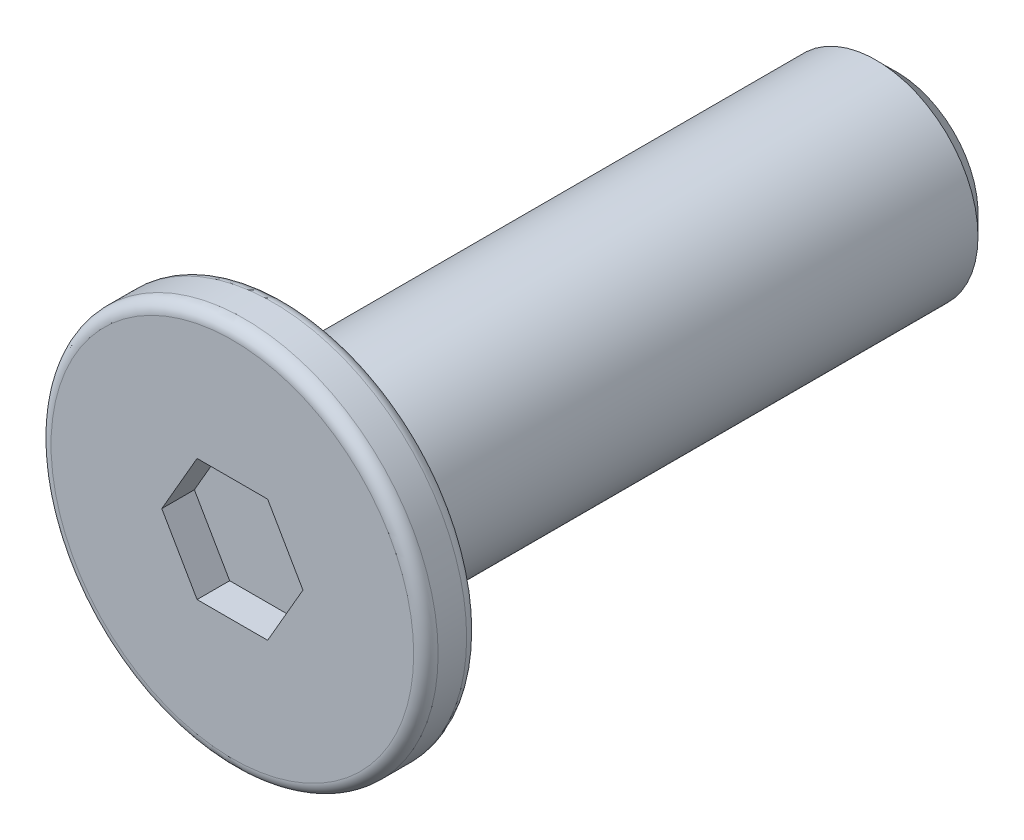
ISO-10303-21;
HEADER;
FILE_DESCRIPTION(('STEP AP214'),'2;1');
FILE_NAME('part.step','',(''),(''),'','','');
FILE_SCHEMA(('AUTOMOTIVE_DESIGN { 1 0 10303 214 1 1 1 1 }'));
ENDSEC;
DATA;
#1=APPLICATION_CONTEXT('core data for automotive mechanical design processes');
#2=APPLICATION_PROTOCOL_DEFINITION('international standard','automotive_design',2000,#1);
#3=PRODUCT_CONTEXT('',#1,'mechanical');
#4=PRODUCT('Part','Part','',(#3));
#5=PRODUCT_RELATED_PRODUCT_CATEGORY('part','',(#4));
#6=PRODUCT_DEFINITION_FORMATION('','',#4);
#7=PRODUCT_DEFINITION_CONTEXT('part definition',#1,'design');
#8=PRODUCT_DEFINITION('design','',#6,#7);
#9=PRODUCT_DEFINITION_SHAPE('','',#8);
#10=(LENGTH_UNIT() NAMED_UNIT(*) SI_UNIT(.MILLI.,.METRE.));
#11=(NAMED_UNIT(*) PLANE_ANGLE_UNIT() SI_UNIT($,.RADIAN.));
#12=(NAMED_UNIT(*) SI_UNIT($,.STERADIAN.) SOLID_ANGLE_UNIT());
#13=UNCERTAINTY_MEASURE_WITH_UNIT(LENGTH_MEASURE(1.E-05),#10,'distance_accuracy_value','');
#14=(GEOMETRIC_REPRESENTATION_CONTEXT(3) GLOBAL_UNCERTAINTY_ASSIGNED_CONTEXT((#13)) GLOBAL_UNIT_ASSIGNED_CONTEXT((#10,
#11,#12)) REPRESENTATION_CONTEXT('',''));
#15=CARTESIAN_POINT('',(0.,0.,0.));
#16=DIRECTION('',(0.,0.,1.));
#17=DIRECTION('',(1.,0.,0.));
#18=AXIS2_PLACEMENT_3D('',#15,#16,#17);
#19=CARTESIAN_POINT('',(0.,0.,0.65));
#20=DIRECTION('',(0.,0.,-1.));
#21=DIRECTION('',(-1.,0.,0.));
#22=AXIS2_PLACEMENT_3D('',#19,#20,#21);
#23=CYLINDRICAL_SURFACE('',#22,4.75);
#24=CARTESIAN_POINT('',(0.,0.,-0.35));
#25=DIRECTION('',(0.,0.,1.));
#26=DIRECTION('',(1.,0.,0.));
#27=AXIS2_PLACEMENT_3D('',#24,#25,#26);
#28=CIRCLE('',#27,4.75);
#29=CARTESIAN_POINT('',(4.75,0.,-0.35));
#30=VERTEX_POINT('',#29);
#31=EDGE_CURVE('E154',#30,#30,#28,.T.);
#32=ORIENTED_EDGE('',*,*,#31,.T.);
#33=EDGE_LOOP('',(#32));
#34=FACE_BOUND('',#33,.T.);
#35=CARTESIAN_POINT('',(0.,0.,0.35));
#36=DIRECTION('',(0.,0.,1.));
#37=DIRECTION('',(1.,0.,0.));
#38=AXIS2_PLACEMENT_3D('',#35,#36,#37);
#39=CIRCLE('',#38,4.75);
#40=CARTESIAN_POINT('',(4.75,0.,0.35));
#41=VERTEX_POINT('',#40);
#42=EDGE_CURVE('E151',#41,#41,#39,.F.);
#43=ORIENTED_EDGE('',*,*,#42,.T.);
#44=EDGE_LOOP('',(#43));
#45=FACE_BOUND('',#44,.T.);
#46=ADVANCED_FACE('F35',(#34,#45),#23,.T.);
#47=CARTESIAN_POINT('',(0.,0.,0.65));
#48=DIRECTION('',(0.,0.,1.));
#49=DIRECTION('',(1.,0.,0.));
#50=AXIS2_PLACEMENT_3D('',#47,#48,#49);
#51=PLANE('',#50);
#52=CARTESIAN_POINT('',(0.,0.,0.65));
#53=DIRECTION('',(0.,0.,1.));
#54=DIRECTION('',(1.,0.,0.));
#55=AXIS2_PLACEMENT_3D('',#52,#53,#54);
#56=CIRCLE('',#55,4.45);
#57=CARTESIAN_POINT('',(4.45,0.,0.65));
#58=VERTEX_POINT('',#57);
#59=EDGE_CURVE('E11',#58,#58,#56,.T.);
#60=ORIENTED_EDGE('',*,*,#59,.T.);
#61=EDGE_LOOP('',(#60));
#62=FACE_BOUND('',#61,.T.);
#63=DIRECTION('',(0.5,0.866025403784439,0.));
#64=VECTOR('',#63,1.);
#65=CARTESIAN_POINT('',(0.86602540378444,-1.5,0.65));
#66=LINE('',#65,#64);
#67=CARTESIAN_POINT('',(0.86602540378444,-1.5,0.65));
#68=VERTEX_POINT('',#67);
#69=CARTESIAN_POINT('',(1.73205080756888,0.,0.65));
#70=VERTEX_POINT('',#69);
#71=EDGE_CURVE('E50',#68,#70,#66,.T.);
#72=ORIENTED_EDGE('',*,*,#71,.F.);
#73=DIRECTION('',(1.,0.,0.));
#74=VECTOR('',#73,1.);
#75=CARTESIAN_POINT('',(-0.866025403784438,-1.5,0.65));
#76=LINE('',#75,#74);
#77=CARTESIAN_POINT('',(-0.866025403784438,-1.5,0.65));
#78=VERTEX_POINT('',#77);
#79=EDGE_CURVE('E133',#78,#68,#76,.T.);
#80=ORIENTED_EDGE('',*,*,#79,.F.);
#81=DIRECTION('',(0.5,-0.866025403784439,0.));
#82=VECTOR('',#81,1.);
#83=CARTESIAN_POINT('',(-1.73205080756888,0.,0.65));
#84=LINE('',#83,#82);
#85=CARTESIAN_POINT('',(-1.73205080756888,0.,0.65));
#86=VERTEX_POINT('',#85);
#87=EDGE_CURVE('E131',#86,#78,#84,.T.);
#88=ORIENTED_EDGE('',*,*,#87,.F.);
#89=DIRECTION('',(-0.5,-0.866025403784439,0.));
#90=VECTOR('',#89,1.);
#91=CARTESIAN_POINT('',(-0.866025403784438,1.5,0.65));
#92=LINE('',#91,#90);
#93=CARTESIAN_POINT('',(-0.866025403784438,1.5,0.65));
#94=VERTEX_POINT('',#93);
#95=EDGE_CURVE('E98',#94,#86,#92,.T.);
#96=ORIENTED_EDGE('',*,*,#95,.F.);
#97=DIRECTION('',(-1.,0.,0.));
#98=VECTOR('',#97,1.);
#99=CARTESIAN_POINT('',(0.866025403784438,1.5,0.65));
#100=LINE('',#99,#98);
#101=CARTESIAN_POINT('',(0.866025403784438,1.5,0.65));
#102=VERTEX_POINT('',#101);
#103=EDGE_CURVE('E127',#102,#94,#100,.T.);
#104=ORIENTED_EDGE('',*,*,#103,.F.);
#105=DIRECTION('',(-0.5,0.866025403784438,0.));
#106=VECTOR('',#105,1.);
#107=CARTESIAN_POINT('',(1.73205080756888,0.,0.65));
#108=LINE('',#107,#106);
#109=EDGE_CURVE('E124',#70,#102,#108,.T.);
#110=ORIENTED_EDGE('',*,*,#109,.F.);
#111=EDGE_LOOP('',(#72,#80,#88,#96,#104,#110));
#112=FACE_BOUND('',#111,.T.);
#113=ADVANCED_FACE('F169',(#62,#112),#51,.T.);
#114=CARTESIAN_POINT('',(0.,0.,-0.65));
#115=DIRECTION('',(0.,0.,1.));
#116=DIRECTION('',(1.,0.,0.));
#117=AXIS2_PLACEMENT_3D('',#114,#115,#116);
#118=PLANE('',#117);
#119=CARTESIAN_POINT('',(0.,0.,-0.65));
#120=DIRECTION('',(0.,0.,1.));
#121=DIRECTION('',(1.,0.,0.));
#122=AXIS2_PLACEMENT_3D('',#119,#120,#121);
#123=CIRCLE('',#122,4.45);
#124=CARTESIAN_POINT('',(4.45,0.,-0.65));
#125=VERTEX_POINT('',#124);
#126=EDGE_CURVE('E43',#125,#125,#123,.F.);
#127=ORIENTED_EDGE('',*,*,#126,.T.);
#128=EDGE_LOOP('',(#127));
#129=FACE_BOUND('',#128,.T.);
#130=CARTESIAN_POINT('',(0.,0.,-0.65));
#131=DIRECTION('',(0.,0.,-1.));
#132=DIRECTION('',(-1.,0.,0.));
#133=AXIS2_PLACEMENT_3D('',#130,#131,#132);
#134=CIRCLE('',#133,2.5);
#135=CARTESIAN_POINT('',(-2.5,0.,-0.65));
#136=VERTEX_POINT('',#135);
#137=EDGE_CURVE('E137',#136,#136,#134,.T.);
#138=ORIENTED_EDGE('',*,*,#137,.F.);
#139=EDGE_LOOP('',(#138));
#140=FACE_BOUND('',#139,.T.);
#141=ADVANCED_FACE('F159',(#129,#140),#118,.F.);
#142=CARTESIAN_POINT('',(0.,0.,-15.65));
#143=DIRECTION('',(0.,0.,1.));
#144=DIRECTION('',(1.,0.,0.));
#145=AXIS2_PLACEMENT_3D('',#142,#143,#144);
#146=CYLINDRICAL_SURFACE('',#145,2.5);
#147=CARTESIAN_POINT('',(0.,0.,-15.15));
#148=DIRECTION('',(0.,0.,-1.));
#149=DIRECTION('',(-1.,0.,0.));
#150=AXIS2_PLACEMENT_3D('',#147,#148,#149);
#151=CIRCLE('',#150,2.5);
#152=CARTESIAN_POINT('',(-2.5,0.,-15.15));
#153=VERTEX_POINT('',#152);
#154=EDGE_CURVE('E148',#153,#153,#151,.F.);
#155=ORIENTED_EDGE('',*,*,#154,.T.);
#156=EDGE_LOOP('',(#155));
#157=FACE_BOUND('',#156,.T.);
#158=ORIENTED_EDGE('',*,*,#137,.T.);
#159=EDGE_LOOP('',(#158));
#160=FACE_BOUND('',#159,.T.);
#161=ADVANCED_FACE('F204',(#157,#160),#146,.T.);
#162=CARTESIAN_POINT('',(0.,0.,-15.65));
#163=DIRECTION('',(0.,0.,-1.));
#164=DIRECTION('',(-1.,0.,0.));
#165=AXIS2_PLACEMENT_3D('',#162,#163,#164);
#166=PLANE('',#165);
#167=CARTESIAN_POINT('',(0.,0.,-15.65));
#168=DIRECTION('',(0.,0.,-1.));
#169=DIRECTION('',(-1.,0.,0.));
#170=AXIS2_PLACEMENT_3D('',#167,#168,#169);
#171=CIRCLE('',#170,2.);
#172=CARTESIAN_POINT('',(-2.,0.,-15.65));
#173=VERTEX_POINT('',#172);
#174=EDGE_CURVE('E145',#173,#173,#171,.T.);
#175=ORIENTED_EDGE('',*,*,#174,.T.);
#176=EDGE_LOOP('',(#175));
#177=FACE_BOUND('',#176,.T.);
#178=ADVANCED_FACE('F196',(#177),#166,.T.);
#179=CARTESIAN_POINT('',(0.,0.,-15.65));
#180=DIRECTION('',(0.,0.,1.));
#181=DIRECTION('',(1.,0.,0.));
#182=AXIS2_PLACEMENT_3D('',#179,#180,#181);
#183=CONICAL_SURFACE('',#182,2.,0.785398163397441);
#184=ORIENTED_EDGE('',*,*,#154,.F.);
#185=EDGE_LOOP('',(#184));
#186=FACE_BOUND('',#185,.T.);
#187=ORIENTED_EDGE('',*,*,#174,.F.);
#188=EDGE_LOOP('',(#187));
#189=FACE_BOUND('',#188,.T.);
#190=ADVANCED_FACE('F189',(#186,#189),#183,.T.);
#191=CARTESIAN_POINT('',(0.86602540378444,-1.5,-0.15));
#192=DIRECTION('',(0.866025403784439,-0.5,0.));
#193=DIRECTION('',(0.5,0.866025403784439,0.));
#194=AXIS2_PLACEMENT_3D('',#191,#192,#193);
#195=PLANE('',#194);
#196=ORIENTED_EDGE('',*,*,#71,.T.);
#197=DIRECTION('',(0.,0.,1.));
#198=VECTOR('',#197,1.);
#199=CARTESIAN_POINT('',(1.73205080756888,0.,-0.15));
#200=LINE('',#199,#198);
#201=CARTESIAN_POINT('',(1.73205080756888,0.,-0.15));
#202=VERTEX_POINT('',#201);
#203=EDGE_CURVE('E80',#202,#70,#200,.T.);
#204=ORIENTED_EDGE('',*,*,#203,.F.);
#205=DIRECTION('',(0.5,0.866025403784439,0.));
#206=VECTOR('',#205,1.);
#207=CARTESIAN_POINT('',(0.86602540378444,-1.5,-0.15));
#208=LINE('',#207,#206);
#209=CARTESIAN_POINT('',(0.86602540378444,-1.5,-0.15));
#210=VERTEX_POINT('',#209);
#211=EDGE_CURVE('E135',#210,#202,#208,.T.);
#212=ORIENTED_EDGE('',*,*,#211,.F.);
#213=DIRECTION('',(0.,0.,1.));
#214=VECTOR('',#213,1.);
#215=CARTESIAN_POINT('',(0.86602540378444,-1.5,-0.15));
#216=LINE('',#215,#214);
#217=EDGE_CURVE('E58',#210,#68,#216,.T.);
#218=ORIENTED_EDGE('',*,*,#217,.T.);
#219=EDGE_LOOP('',(#196,#204,#212,#218));
#220=FACE_BOUND('',#219,.T.);
#221=ADVANCED_FACE('F186',(#220),#195,.F.);
#222=CARTESIAN_POINT('',(-0.866025403784438,-1.5,-0.15));
#223=DIRECTION('',(0.,-1.,0.));
#224=DIRECTION('',(1.,0.,0.));
#225=AXIS2_PLACEMENT_3D('',#222,#223,#224);
#226=PLANE('',#225);
#227=ORIENTED_EDGE('',*,*,#79,.T.);
#228=ORIENTED_EDGE('',*,*,#217,.F.);
#229=DIRECTION('',(1.,0.,0.));
#230=VECTOR('',#229,1.);
#231=CARTESIAN_POINT('',(-0.866025403784438,-1.5,-0.15));
#232=LINE('',#231,#230);
#233=CARTESIAN_POINT('',(-0.866025403784438,-1.5,-0.15));
#234=VERTEX_POINT('',#233);
#235=EDGE_CURVE('E110',#234,#210,#232,.T.);
#236=ORIENTED_EDGE('',*,*,#235,.F.);
#237=DIRECTION('',(0.,0.,1.));
#238=VECTOR('',#237,1.);
#239=CARTESIAN_POINT('',(-0.866025403784438,-1.5,-0.15));
#240=LINE('',#239,#238);
#241=EDGE_CURVE('E102',#234,#78,#240,.T.);
#242=ORIENTED_EDGE('',*,*,#241,.T.);
#243=EDGE_LOOP('',(#227,#228,#236,#242));
#244=FACE_BOUND('',#243,.T.);
#245=ADVANCED_FACE('F188',(#244),#226,.F.);
#246=CARTESIAN_POINT('',(-1.73205080756888,0.,-0.15));
#247=DIRECTION('',(-0.866025403784439,-0.5,0.));
#248=DIRECTION('',(0.5,-0.866025403784439,0.));
#249=AXIS2_PLACEMENT_3D('',#246,#247,#248);
#250=PLANE('',#249);
#251=ORIENTED_EDGE('',*,*,#87,.T.);
#252=ORIENTED_EDGE('',*,*,#241,.F.);
#253=DIRECTION('',(0.5,-0.866025403784439,0.));
#254=VECTOR('',#253,1.);
#255=CARTESIAN_POINT('',(-1.73205080756888,0.,-0.15));
#256=LINE('',#255,#254);
#257=CARTESIAN_POINT('',(-1.73205080756888,0.,-0.15));
#258=VERTEX_POINT('',#257);
#259=EDGE_CURVE('E106',#258,#234,#256,.T.);
#260=ORIENTED_EDGE('',*,*,#259,.F.);
#261=DIRECTION('',(0.,0.,1.));
#262=VECTOR('',#261,1.);
#263=CARTESIAN_POINT('',(-1.73205080756888,0.,-0.15));
#264=LINE('',#263,#262);
#265=EDGE_CURVE('E91',#258,#86,#264,.T.);
#266=ORIENTED_EDGE('',*,*,#265,.T.);
#267=EDGE_LOOP('',(#251,#252,#260,#266));
#268=FACE_BOUND('',#267,.T.);
#269=ADVANCED_FACE('F107',(#268),#250,.F.);
#270=CARTESIAN_POINT('',(-0.866025403784438,1.5,-0.15));
#271=DIRECTION('',(-0.866025403784439,0.5,0.));
#272=DIRECTION('',(-0.5,-0.866025403784439,0.));
#273=AXIS2_PLACEMENT_3D('',#270,#271,#272);
#274=PLANE('',#273);
#275=ORIENTED_EDGE('',*,*,#95,.T.);
#276=ORIENTED_EDGE('',*,*,#265,.F.);
#277=DIRECTION('',(-0.5,-0.866025403784439,0.));
#278=VECTOR('',#277,1.);
#279=CARTESIAN_POINT('',(-0.866025403784438,1.5,-0.15));
#280=LINE('',#279,#278);
#281=CARTESIAN_POINT('',(-0.866025403784438,1.5,-0.15));
#282=VERTEX_POINT('',#281);
#283=EDGE_CURVE('E95',#282,#258,#280,.T.);
#284=ORIENTED_EDGE('',*,*,#283,.F.);
#285=DIRECTION('',(0.,0.,1.));
#286=VECTOR('',#285,1.);
#287=CARTESIAN_POINT('',(-0.866025403784438,1.5,-0.15));
#288=LINE('',#287,#286);
#289=EDGE_CURVE('E103',#282,#94,#288,.T.);
#290=ORIENTED_EDGE('',*,*,#289,.T.);
#291=EDGE_LOOP('',(#275,#276,#284,#290));
#292=FACE_BOUND('',#291,.T.);
#293=ADVANCED_FACE('F93',(#292),#274,.F.);
#294=CARTESIAN_POINT('',(0.866025403784438,1.5,-0.15));
#295=DIRECTION('',(0.,1.,0.));
#296=DIRECTION('',(0.,0.,1.));
#297=AXIS2_PLACEMENT_3D('',#294,#295,#296);
#298=PLANE('',#297);
#299=ORIENTED_EDGE('',*,*,#103,.T.);
#300=ORIENTED_EDGE('',*,*,#289,.F.);
#301=DIRECTION('',(-1.,0.,0.));
#302=VECTOR('',#301,1.);
#303=CARTESIAN_POINT('',(0.866025403784438,1.5,-0.15));
#304=LINE('',#303,#302);
#305=CARTESIAN_POINT('',(0.866025403784438,1.5,-0.15));
#306=VERTEX_POINT('',#305);
#307=EDGE_CURVE('E116',#306,#282,#304,.T.);
#308=ORIENTED_EDGE('',*,*,#307,.F.);
#309=DIRECTION('',(0.,0.,1.));
#310=VECTOR('',#309,1.);
#311=CARTESIAN_POINT('',(0.866025403784438,1.5,-0.15));
#312=LINE('',#311,#310);
#313=EDGE_CURVE('E140',#306,#102,#312,.T.);
#314=ORIENTED_EDGE('',*,*,#313,.T.);
#315=EDGE_LOOP('',(#299,#300,#308,#314));
#316=FACE_BOUND('',#315,.T.);
#317=ADVANCED_FACE('F257',(#316),#298,.F.);
#318=CARTESIAN_POINT('',(1.73205080756888,0.,-0.15));
#319=DIRECTION('',(0.866025403784438,0.5,0.));
#320=DIRECTION('',(-0.5,0.866025403784438,0.));
#321=AXIS2_PLACEMENT_3D('',#318,#319,#320);
#322=PLANE('',#321);
#323=ORIENTED_EDGE('',*,*,#109,.T.);
#324=ORIENTED_EDGE('',*,*,#313,.F.);
#325=DIRECTION('',(-0.5,0.866025403784438,0.));
#326=VECTOR('',#325,1.);
#327=CARTESIAN_POINT('',(1.73205080756888,0.,-0.15));
#328=LINE('',#327,#326);
#329=EDGE_CURVE('E118',#202,#306,#328,.T.);
#330=ORIENTED_EDGE('',*,*,#329,.F.);
#331=ORIENTED_EDGE('',*,*,#203,.T.);
#332=EDGE_LOOP('',(#323,#324,#330,#331));
#333=FACE_BOUND('',#332,.T.);
#334=ADVANCED_FACE('F184',(#333),#322,.F.);
#335=CARTESIAN_POINT('',(0.,0.,-0.15));
#336=DIRECTION('',(0.,0.,1.));
#337=DIRECTION('',(1.,0.,0.));
#338=AXIS2_PLACEMENT_3D('',#335,#336,#337);
#339=PLANE('',#338);
#340=ORIENTED_EDGE('',*,*,#211,.T.);
#341=ORIENTED_EDGE('',*,*,#329,.T.);
#342=ORIENTED_EDGE('',*,*,#307,.T.);
#343=ORIENTED_EDGE('',*,*,#283,.T.);
#344=ORIENTED_EDGE('',*,*,#259,.T.);
#345=ORIENTED_EDGE('',*,*,#235,.T.);
#346=EDGE_LOOP('',(#340,#341,#342,#343,#344,#345));
#347=FACE_BOUND('',#346,.T.);
#348=ADVANCED_FACE('F113',(#347),#339,.T.);
#349=CARTESIAN_POINT('',(0.,0.,-0.35));
#350=DIRECTION('',(0.,0.,1.));
#351=DIRECTION('',(1.,0.,0.));
#352=AXIS2_PLACEMENT_3D('',#349,#350,#351);
#353=TOROIDAL_SURFACE('',#352,4.45,0.3);
#354=ORIENTED_EDGE('',*,*,#126,.F.);
#355=EDGE_LOOP('',(#354));
#356=FACE_BOUND('',#355,.T.);
#357=ORIENTED_EDGE('',*,*,#31,.F.);
#358=EDGE_LOOP('',(#357));
#359=FACE_BOUND('',#358,.T.);
#360=ADVANCED_FACE('F162',(#356,#359),#353,.T.);
#361=CARTESIAN_POINT('',(0.,0.,0.35));
#362=DIRECTION('',(0.,0.,1.));
#363=DIRECTION('',(1.,0.,0.));
#364=AXIS2_PLACEMENT_3D('',#361,#362,#363);
#365=TOROIDAL_SURFACE('',#364,4.45,0.3);
#366=ORIENTED_EDGE('',*,*,#42,.F.);
#367=EDGE_LOOP('',(#366));
#368=FACE_BOUND('',#367,.T.);
#369=ORIENTED_EDGE('',*,*,#59,.F.);
#370=EDGE_LOOP('',(#369));
#371=FACE_BOUND('',#370,.T.);
#372=ADVANCED_FACE('F37',(#368,#371),#365,.T.);
#373=CLOSED_SHELL('',(#46,#113,#141,#161,#178,#190,#221,#245,#269,#293,#317,#334,#348,#360,#372));
#374=MANIFOLD_SOLID_BREP('B2',#373);
#375=ADVANCED_BREP_SHAPE_REPRESENTATION('',(#18,#374),#14);
#376=SHAPE_DEFINITION_REPRESENTATION(#9,#375);
ENDSEC;
END-ISO-10303-21;
